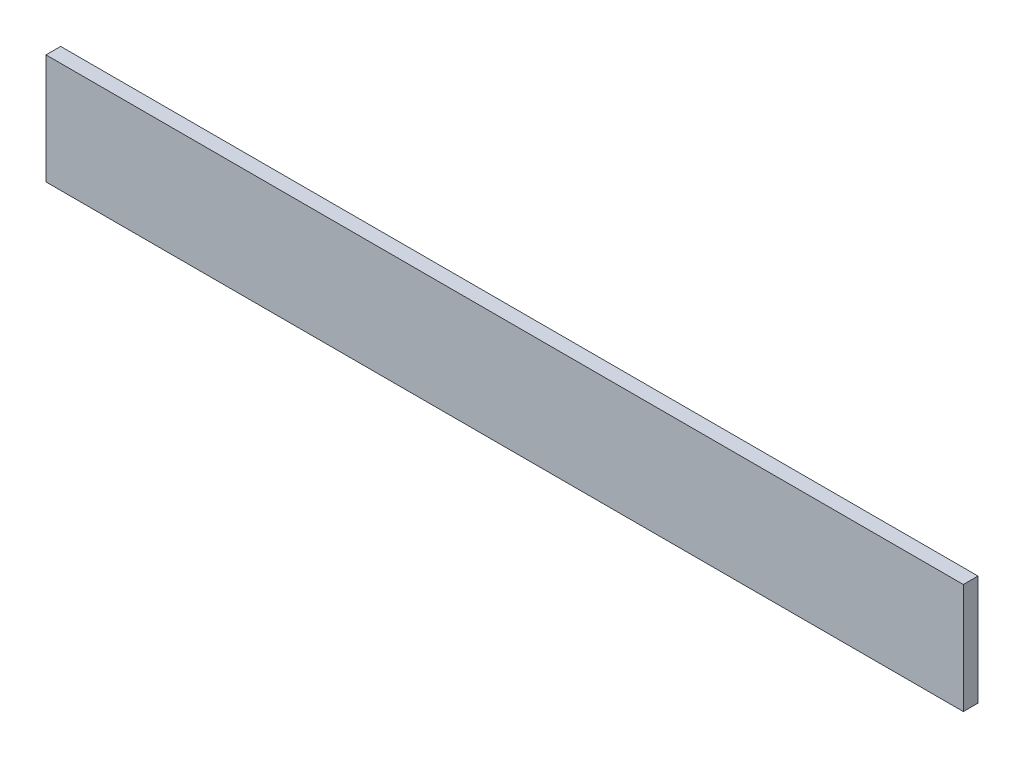
ISO-10303-21;
HEADER;
FILE_DESCRIPTION(('STEP AP214'),'2;1');
FILE_NAME('part.step','',(''),(''),'','','');
FILE_SCHEMA(('AUTOMOTIVE_DESIGN { 1 0 10303 214 1 1 1 1 }'));
ENDSEC;
DATA;
#1=APPLICATION_CONTEXT('core data for automotive mechanical design processes');
#2=APPLICATION_PROTOCOL_DEFINITION('international standard','automotive_design',2000,#1);
#3=PRODUCT_CONTEXT('',#1,'mechanical');
#4=PRODUCT('Part','Part','',(#3));
#5=PRODUCT_RELATED_PRODUCT_CATEGORY('part','',(#4));
#6=PRODUCT_DEFINITION_FORMATION('','',#4);
#7=PRODUCT_DEFINITION_CONTEXT('part definition',#1,'design');
#8=PRODUCT_DEFINITION('design','',#6,#7);
#9=PRODUCT_DEFINITION_SHAPE('','',#8);
#10=(LENGTH_UNIT() NAMED_UNIT(*) SI_UNIT(.MILLI.,.METRE.));
#11=(NAMED_UNIT(*) PLANE_ANGLE_UNIT() SI_UNIT($,.RADIAN.));
#12=(NAMED_UNIT(*) SI_UNIT($,.STERADIAN.) SOLID_ANGLE_UNIT());
#13=UNCERTAINTY_MEASURE_WITH_UNIT(LENGTH_MEASURE(1.E-05),#10,'distance_accuracy_value','');
#14=(GEOMETRIC_REPRESENTATION_CONTEXT(3) GLOBAL_UNCERTAINTY_ASSIGNED_CONTEXT((#13)) GLOBAL_UNIT_ASSIGNED_CONTEXT((#10,
#11,#12)) REPRESENTATION_CONTEXT('',''));
#15=CARTESIAN_POINT('',(0.,0.,0.));
#16=DIRECTION('',(0.,0.,1.));
#17=DIRECTION('',(1.,0.,0.));
#18=AXIS2_PLACEMENT_3D('',#15,#16,#17);
#19=CARTESIAN_POINT('',(250.,-30.,4.));
#20=DIRECTION('',(-1.,0.,0.));
#21=DIRECTION('',(0.,0.,1.));
#22=AXIS2_PLACEMENT_3D('',#19,#20,#21);
#23=PLANE('',#22);
#24=DIRECTION('',(0.,1.,0.));
#25=VECTOR('',#24,1.);
#26=CARTESIAN_POINT('',(250.,-30.,-4.));
#27=LINE('',#26,#25);
#28=CARTESIAN_POINT('',(250.,-30.,-4.));
#29=VERTEX_POINT('',#28);
#30=CARTESIAN_POINT('',(250.,30.,-4.));
#31=VERTEX_POINT('',#30);
#32=EDGE_CURVE('E96',#29,#31,#27,.T.);
#33=ORIENTED_EDGE('',*,*,#32,.T.);
#34=DIRECTION('',(0.,0.,-1.));
#35=VECTOR('',#34,1.);
#36=CARTESIAN_POINT('',(250.,30.,4.));
#37=LINE('',#36,#35);
#38=CARTESIAN_POINT('',(250.,30.,4.));
#39=VERTEX_POINT('',#38);
#40=EDGE_CURVE('E11',#39,#31,#37,.T.);
#41=ORIENTED_EDGE('',*,*,#40,.F.);
#42=DIRECTION('',(0.,1.,0.));
#43=VECTOR('',#42,1.);
#44=CARTESIAN_POINT('',(250.,-30.,4.));
#45=LINE('',#44,#43);
#46=CARTESIAN_POINT('',(250.,-30.,4.));
#47=VERTEX_POINT('',#46);
#48=EDGE_CURVE('E84',#47,#39,#45,.T.);
#49=ORIENTED_EDGE('',*,*,#48,.F.);
#50=DIRECTION('',(0.,0.,-1.));
#51=VECTOR('',#50,1.);
#52=CARTESIAN_POINT('',(250.,-30.,4.));
#53=LINE('',#52,#51);
#54=EDGE_CURVE('E92',#47,#29,#53,.T.);
#55=ORIENTED_EDGE('',*,*,#54,.T.);
#56=EDGE_LOOP('',(#33,#41,#49,#55));
#57=FACE_BOUND('',#56,.T.);
#58=ADVANCED_FACE('F33',(#57),#23,.F.);
#59=CARTESIAN_POINT('',(-250.,30.,4.));
#60=DIRECTION('',(0.,-1.,0.));
#61=DIRECTION('',(0.,0.,-1.));
#62=AXIS2_PLACEMENT_3D('',#59,#60,#61);
#63=PLANE('',#62);
#64=DIRECTION('',(-1.,0.,0.));
#65=VECTOR('',#64,1.);
#66=CARTESIAN_POINT('',(-250.,30.,-4.));
#67=LINE('',#66,#65);
#68=CARTESIAN_POINT('',(-250.,30.,-4.));
#69=VERTEX_POINT('',#68);
#70=EDGE_CURVE('E88',#31,#69,#67,.T.);
#71=ORIENTED_EDGE('',*,*,#70,.T.);
#72=DIRECTION('',(0.,0.,-1.));
#73=VECTOR('',#72,1.);
#74=CARTESIAN_POINT('',(-250.,30.,4.));
#75=LINE('',#74,#73);
#76=CARTESIAN_POINT('',(-250.,30.,4.));
#77=VERTEX_POINT('',#76);
#78=EDGE_CURVE('E41',#77,#69,#75,.T.);
#79=ORIENTED_EDGE('',*,*,#78,.F.);
#80=DIRECTION('',(-1.,0.,0.));
#81=VECTOR('',#80,1.);
#82=CARTESIAN_POINT('',(-250.,30.,4.));
#83=LINE('',#82,#81);
#84=EDGE_CURVE('E79',#39,#77,#83,.T.);
#85=ORIENTED_EDGE('',*,*,#84,.F.);
#86=ORIENTED_EDGE('',*,*,#40,.T.);
#87=EDGE_LOOP('',(#71,#79,#85,#86));
#88=FACE_BOUND('',#87,.T.);
#89=ADVANCED_FACE('F87',(#88),#63,.F.);
#90=CARTESIAN_POINT('',(-250.,-30.,4.));
#91=DIRECTION('',(1.,0.,0.));
#92=DIRECTION('',(0.,0.,-1.));
#93=AXIS2_PLACEMENT_3D('',#90,#91,#92);
#94=PLANE('',#93);
#95=DIRECTION('',(0.,-1.,0.));
#96=VECTOR('',#95,1.);
#97=CARTESIAN_POINT('',(-250.,-30.,-4.));
#98=LINE('',#97,#96);
#99=CARTESIAN_POINT('',(-250.,-30.,-4.));
#100=VERTEX_POINT('',#99);
#101=EDGE_CURVE('E66',#69,#100,#98,.T.);
#102=ORIENTED_EDGE('',*,*,#101,.T.);
#103=DIRECTION('',(0.,0.,-1.));
#104=VECTOR('',#103,1.);
#105=CARTESIAN_POINT('',(-250.,-30.,4.));
#106=LINE('',#105,#104);
#107=CARTESIAN_POINT('',(-250.,-30.,4.));
#108=VERTEX_POINT('',#107);
#109=EDGE_CURVE('E89',#108,#100,#106,.T.);
#110=ORIENTED_EDGE('',*,*,#109,.F.);
#111=DIRECTION('',(0.,-1.,0.));
#112=VECTOR('',#111,1.);
#113=CARTESIAN_POINT('',(-250.,-30.,4.));
#114=LINE('',#113,#112);
#115=EDGE_CURVE('E82',#77,#108,#114,.T.);
#116=ORIENTED_EDGE('',*,*,#115,.F.);
#117=ORIENTED_EDGE('',*,*,#78,.T.);
#118=EDGE_LOOP('',(#102,#110,#116,#117));
#119=FACE_BOUND('',#118,.T.);
#120=ADVANCED_FACE('F90',(#119),#94,.F.);
#121=CARTESIAN_POINT('',(-250.,-30.,4.));
#122=DIRECTION('',(0.,1.,0.));
#123=DIRECTION('',(0.,0.,1.));
#124=AXIS2_PLACEMENT_3D('',#121,#122,#123);
#125=PLANE('',#124);
#126=DIRECTION('',(1.,0.,0.));
#127=VECTOR('',#126,1.);
#128=CARTESIAN_POINT('',(-250.,-30.,-4.));
#129=LINE('',#128,#127);
#130=EDGE_CURVE('E72',#100,#29,#129,.T.);
#131=ORIENTED_EDGE('',*,*,#130,.T.);
#132=ORIENTED_EDGE('',*,*,#54,.F.);
#133=DIRECTION('',(1.,0.,0.));
#134=VECTOR('',#133,1.);
#135=CARTESIAN_POINT('',(-250.,-30.,4.));
#136=LINE('',#135,#134);
#137=EDGE_CURVE('E49',#108,#47,#136,.T.);
#138=ORIENTED_EDGE('',*,*,#137,.F.);
#139=ORIENTED_EDGE('',*,*,#109,.T.);
#140=EDGE_LOOP('',(#131,#132,#138,#139));
#141=FACE_BOUND('',#140,.T.);
#142=ADVANCED_FACE('F103',(#141),#125,.F.);
#143=CARTESIAN_POINT('',(0.,0.,4.));
#144=DIRECTION('',(0.,0.,-1.));
#145=DIRECTION('',(-1.,0.,0.));
#146=AXIS2_PLACEMENT_3D('',#143,#144,#145);
#147=PLANE('',#146);
#148=ORIENTED_EDGE('',*,*,#48,.T.);
#149=ORIENTED_EDGE('',*,*,#84,.T.);
#150=ORIENTED_EDGE('',*,*,#115,.T.);
#151=ORIENTED_EDGE('',*,*,#137,.T.);
#152=EDGE_LOOP('',(#148,#149,#150,#151));
#153=FACE_BOUND('',#152,.T.);
#154=ADVANCED_FACE('F80',(#153),#147,.F.);
#155=CARTESIAN_POINT('',(0.,0.,-4.));
#156=DIRECTION('',(0.,0.,-1.));
#157=DIRECTION('',(-1.,0.,0.));
#158=AXIS2_PLACEMENT_3D('',#155,#156,#157);
#159=PLANE('',#158);
#160=ORIENTED_EDGE('',*,*,#32,.F.);
#161=ORIENTED_EDGE('',*,*,#130,.F.);
#162=ORIENTED_EDGE('',*,*,#101,.F.);
#163=ORIENTED_EDGE('',*,*,#70,.F.);
#164=EDGE_LOOP('',(#160,#161,#162,#163));
#165=FACE_BOUND('',#164,.T.);
#166=ADVANCED_FACE('F106',(#165),#159,.T.);
#167=CLOSED_SHELL('',(#58,#89,#120,#142,#154,#166));
#168=MANIFOLD_SOLID_BREP('B2',#167);
#169=ADVANCED_BREP_SHAPE_REPRESENTATION('',(#18,#168),#14);
#170=SHAPE_DEFINITION_REPRESENTATION(#9,#169);
ENDSEC;
END-ISO-10303-21;
